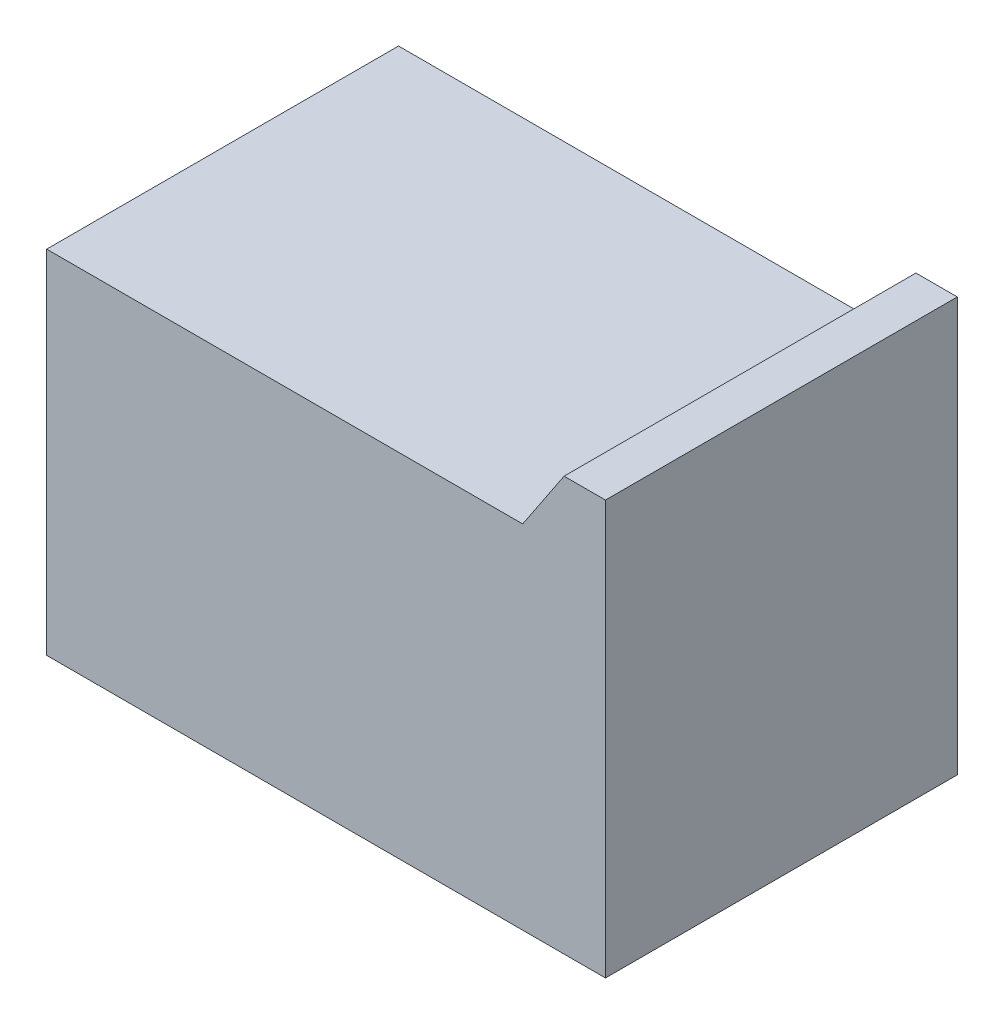
ISO-10303-21;
HEADER;
FILE_DESCRIPTION(('STEP AP214'),'2;1');
FILE_NAME('part.step','',(''),(''),'','','');
FILE_SCHEMA(('AUTOMOTIVE_DESIGN { 1 0 10303 214 1 1 1 1 }'));
ENDSEC;
DATA;
#1=APPLICATION_CONTEXT('core data for automotive mechanical design processes');
#2=APPLICATION_PROTOCOL_DEFINITION('international standard','automotive_design',2000,#1);
#3=PRODUCT_CONTEXT('',#1,'mechanical');
#4=PRODUCT('Part','Part','',(#3));
#5=PRODUCT_RELATED_PRODUCT_CATEGORY('part','',(#4));
#6=PRODUCT_DEFINITION_FORMATION('','',#4);
#7=PRODUCT_DEFINITION_CONTEXT('part definition',#1,'design');
#8=PRODUCT_DEFINITION('design','',#6,#7);
#9=PRODUCT_DEFINITION_SHAPE('','',#8);
#10=(LENGTH_UNIT() NAMED_UNIT(*) SI_UNIT(.MILLI.,.METRE.));
#11=(NAMED_UNIT(*) PLANE_ANGLE_UNIT() SI_UNIT($,.RADIAN.));
#12=(NAMED_UNIT(*) SI_UNIT($,.STERADIAN.) SOLID_ANGLE_UNIT());
#13=UNCERTAINTY_MEASURE_WITH_UNIT(LENGTH_MEASURE(1.E-05),#10,'distance_accuracy_value','');
#14=(GEOMETRIC_REPRESENTATION_CONTEXT(3) GLOBAL_UNCERTAINTY_ASSIGNED_CONTEXT((#13)) GLOBAL_UNIT_ASSIGNED_CONTEXT((#10,
#11,#12)) REPRESENTATION_CONTEXT('',''));
#15=CARTESIAN_POINT('',(0.,0.,0.));
#16=DIRECTION('',(0.,0.,1.));
#17=DIRECTION('',(1.,0.,0.));
#18=AXIS2_PLACEMENT_3D('',#15,#16,#17);
#19=CARTESIAN_POINT('',(342.9,508.,215.9));
#20=DIRECTION('',(-1.,0.,0.));
#21=DIRECTION('',(0.,0.,1.));
#22=AXIS2_PLACEMENT_3D('',#19,#20,#21);
#23=PLANE('',#22);
#24=DIRECTION('',(0.,0.,-1.));
#25=VECTOR('',#24,1.);
#26=CARTESIAN_POINT('',(342.9,0.,215.9));
#27=LINE('',#26,#25);
#28=CARTESIAN_POINT('',(342.9,0.,215.9));
#29=VERTEX_POINT('',#28);
#30=CARTESIAN_POINT('',(342.9,0.,-215.9));
#31=VERTEX_POINT('',#30);
#32=EDGE_CURVE('E92',#29,#31,#27,.T.);
#33=ORIENTED_EDGE('',*,*,#32,.T.);
#34=DIRECTION('',(0.,-1.,0.));
#35=VECTOR('',#34,1.);
#36=CARTESIAN_POINT('',(342.9,508.,-215.9));
#37=LINE('',#36,#35);
#38=CARTESIAN_POINT('',(342.9,508.,-215.9));
#39=VERTEX_POINT('',#38);
#40=EDGE_CURVE('E11',#39,#31,#37,.T.);
#41=ORIENTED_EDGE('',*,*,#40,.F.);
#42=DIRECTION('',(0.,0.,-1.));
#43=VECTOR('',#42,1.);
#44=CARTESIAN_POINT('',(342.9,508.,215.9));
#45=LINE('',#44,#43);
#46=CARTESIAN_POINT('',(342.9,508.,215.9));
#47=VERTEX_POINT('',#46);
#48=EDGE_CURVE('E86',#47,#39,#45,.T.);
#49=ORIENTED_EDGE('',*,*,#48,.F.);
#50=DIRECTION('',(0.,-1.,0.));
#51=VECTOR('',#50,1.);
#52=CARTESIAN_POINT('',(342.9,508.,215.9));
#53=LINE('',#52,#51);
#54=EDGE_CURVE('E77',#47,#29,#53,.T.);
#55=ORIENTED_EDGE('',*,*,#54,.T.);
#56=EDGE_LOOP('',(#33,#41,#49,#55));
#57=FACE_BOUND('',#56,.T.);
#58=ADVANCED_FACE('F33',(#57),#23,.F.);
#59=CARTESIAN_POINT('',(-342.9,508.,-215.9));
#60=DIRECTION('',(0.,0.,1.));
#61=DIRECTION('',(1.,0.,0.));
#62=AXIS2_PLACEMENT_3D('',#59,#60,#61);
#63=PLANE('',#62);
#64=DIRECTION('',(1.,0.,0.));
#65=VECTOR('',#64,1.);
#66=CARTESIAN_POINT('',(-342.9,431.8,-215.9));
#67=LINE('',#66,#65);
#68=CARTESIAN_POINT('',(-342.9,431.8,-215.9));
#69=VERTEX_POINT('',#68);
#70=CARTESIAN_POINT('',(241.3,431.8,-215.9));
#71=VERTEX_POINT('',#70);
#72=EDGE_CURVE('E127',#69,#71,#67,.T.);
#73=ORIENTED_EDGE('',*,*,#72,.T.);
#74=DIRECTION('',(0.55470019622523,0.832050294337843,0.));
#75=VECTOR('',#74,1.);
#76=CARTESIAN_POINT('',(241.3,431.8,-215.9));
#77=LINE('',#76,#75);
#78=CARTESIAN_POINT('',(292.1,508.,-215.9));
#79=VERTEX_POINT('',#78);
#80=EDGE_CURVE('E120',#71,#79,#77,.T.);
#81=ORIENTED_EDGE('',*,*,#80,.T.);
#82=DIRECTION('',(-1.,0.,0.));
#83=VECTOR('',#82,1.);
#84=CARTESIAN_POINT('',(-342.9,508.,-215.9));
#85=LINE('',#84,#83);
#86=EDGE_CURVE('E118',#39,#79,#85,.T.);
#87=ORIENTED_EDGE('',*,*,#86,.F.);
#88=ORIENTED_EDGE('',*,*,#40,.T.);
#89=DIRECTION('',(-1.,0.,0.));
#90=VECTOR('',#89,1.);
#91=CARTESIAN_POINT('',(-342.9,0.,-215.9));
#92=LINE('',#91,#90);
#93=CARTESIAN_POINT('',(-342.9,0.,-215.9));
#94=VERTEX_POINT('',#93);
#95=EDGE_CURVE('E96',#31,#94,#92,.T.);
#96=ORIENTED_EDGE('',*,*,#95,.T.);
#97=DIRECTION('',(0.,-1.,0.));
#98=VECTOR('',#97,1.);
#99=CARTESIAN_POINT('',(-342.9,508.,-215.9));
#100=LINE('',#99,#98);
#101=EDGE_CURVE('E40',#69,#94,#100,.T.);
#102=ORIENTED_EDGE('',*,*,#101,.F.);
#103=EDGE_LOOP('',(#73,#81,#87,#88,#96,#102));
#104=FACE_BOUND('',#103,.T.);
#105=ADVANCED_FACE('F115',(#104),#63,.F.);
#106=CARTESIAN_POINT('',(-342.9,508.,215.9));
#107=DIRECTION('',(1.,0.,0.));
#108=DIRECTION('',(0.,0.,-1.));
#109=AXIS2_PLACEMENT_3D('',#106,#107,#108);
#110=PLANE('',#109);
#111=DIRECTION('',(0.,-1.,0.));
#112=VECTOR('',#111,1.);
#113=CARTESIAN_POINT('',(-342.9,508.,215.9));
#114=LINE('',#113,#112);
#115=CARTESIAN_POINT('',(-342.9,431.8,215.9));
#116=VERTEX_POINT('',#115);
#117=CARTESIAN_POINT('',(-342.9,0.,215.9));
#118=VERTEX_POINT('',#117);
#119=EDGE_CURVE('E81',#116,#118,#114,.T.);
#120=ORIENTED_EDGE('',*,*,#119,.F.);
#121=DIRECTION('',(0.,0.,1.));
#122=VECTOR('',#121,1.);
#123=CARTESIAN_POINT('',(-342.9,431.8,-215.9));
#124=LINE('',#123,#122);
#125=EDGE_CURVE('E112',#69,#116,#124,.T.);
#126=ORIENTED_EDGE('',*,*,#125,.F.);
#127=ORIENTED_EDGE('',*,*,#101,.T.);
#128=DIRECTION('',(0.,0.,1.));
#129=VECTOR('',#128,1.);
#130=CARTESIAN_POINT('',(-342.9,0.,215.9));
#131=LINE('',#130,#129);
#132=EDGE_CURVE('E87',#94,#118,#131,.T.);
#133=ORIENTED_EDGE('',*,*,#132,.T.);
#134=EDGE_LOOP('',(#120,#126,#127,#133));
#135=FACE_BOUND('',#134,.T.);
#136=ADVANCED_FACE('F109',(#135),#110,.F.);
#137=CARTESIAN_POINT('',(-342.9,508.,215.9));
#138=DIRECTION('',(0.,0.,-1.));
#139=DIRECTION('',(-1.,0.,0.));
#140=AXIS2_PLACEMENT_3D('',#137,#138,#139);
#141=PLANE('',#140);
#142=DIRECTION('',(1.,0.,0.));
#143=VECTOR('',#142,1.);
#144=CARTESIAN_POINT('',(-342.9,508.,215.9));
#145=LINE('',#144,#143);
#146=CARTESIAN_POINT('',(292.1,508.,215.9));
#147=VERTEX_POINT('',#146);
#148=EDGE_CURVE('E55',#147,#47,#145,.T.);
#149=ORIENTED_EDGE('',*,*,#148,.F.);
#150=DIRECTION('',(0.55470019622523,0.832050294337843,0.));
#151=VECTOR('',#150,1.);
#152=CARTESIAN_POINT('',(241.3,431.8,215.9));
#153=LINE('',#152,#151);
#154=CARTESIAN_POINT('',(241.3,431.8,215.9));
#155=VERTEX_POINT('',#154);
#156=EDGE_CURVE('E47',#155,#147,#153,.T.);
#157=ORIENTED_EDGE('',*,*,#156,.F.);
#158=DIRECTION('',(1.,0.,0.));
#159=VECTOR('',#158,1.);
#160=CARTESIAN_POINT('',(-342.9,431.8,215.9));
#161=LINE('',#160,#159);
#162=EDGE_CURVE('E128',#116,#155,#161,.T.);
#163=ORIENTED_EDGE('',*,*,#162,.F.);
#164=ORIENTED_EDGE('',*,*,#119,.T.);
#165=DIRECTION('',(1.,0.,0.));
#166=VECTOR('',#165,1.);
#167=CARTESIAN_POINT('',(-342.9,0.,215.9));
#168=LINE('',#167,#166);
#169=EDGE_CURVE('E74',#118,#29,#168,.T.);
#170=ORIENTED_EDGE('',*,*,#169,.T.);
#171=ORIENTED_EDGE('',*,*,#54,.F.);
#172=EDGE_LOOP('',(#149,#157,#163,#164,#170,#171));
#173=FACE_BOUND('',#172,.T.);
#174=ADVANCED_FACE('F76',(#173),#141,.F.);
#175=CARTESIAN_POINT('',(0.,508.,0.));
#176=DIRECTION('',(0.,-1.,0.));
#177=DIRECTION('',(0.,0.,-1.));
#178=AXIS2_PLACEMENT_3D('',#175,#176,#177);
#179=PLANE('',#178);
#180=ORIENTED_EDGE('',*,*,#86,.T.);
#181=DIRECTION('',(0.,0.,1.));
#182=VECTOR('',#181,1.);
#183=CARTESIAN_POINT('',(292.1,508.,-215.9));
#184=LINE('',#183,#182);
#185=EDGE_CURVE('E97',#79,#147,#184,.T.);
#186=ORIENTED_EDGE('',*,*,#185,.T.);
#187=ORIENTED_EDGE('',*,*,#148,.T.);
#188=ORIENTED_EDGE('',*,*,#48,.T.);
#189=EDGE_LOOP('',(#180,#186,#187,#188));
#190=FACE_BOUND('',#189,.T.);
#191=ADVANCED_FACE('F121',(#190),#179,.F.);
#192=CARTESIAN_POINT('',(0.,0.,0.));
#193=DIRECTION('',(0.,-1.,0.));
#194=DIRECTION('',(0.,0.,-1.));
#195=AXIS2_PLACEMENT_3D('',#192,#193,#194);
#196=PLANE('',#195);
#197=ORIENTED_EDGE('',*,*,#32,.F.);
#198=ORIENTED_EDGE('',*,*,#169,.F.);
#199=ORIENTED_EDGE('',*,*,#132,.F.);
#200=ORIENTED_EDGE('',*,*,#95,.F.);
#201=EDGE_LOOP('',(#197,#198,#199,#200));
#202=FACE_BOUND('',#201,.T.);
#203=ADVANCED_FACE('F94',(#202),#196,.T.);
#204=CARTESIAN_POINT('',(241.3,431.8,-215.9));
#205=DIRECTION('',(0.832050294337843,-0.55470019622523,0.));
#206=DIRECTION('',(0.55470019622523,0.832050294337843,0.));
#207=AXIS2_PLACEMENT_3D('',#204,#205,#206);
#208=PLANE('',#207);
#209=ORIENTED_EDGE('',*,*,#156,.T.);
#210=ORIENTED_EDGE('',*,*,#185,.F.);
#211=ORIENTED_EDGE('',*,*,#80,.F.);
#212=DIRECTION('',(0.,0.,1.));
#213=VECTOR('',#212,1.);
#214=CARTESIAN_POINT('',(241.3,431.8,-215.9));
#215=LINE('',#214,#213);
#216=EDGE_CURVE('E100',#71,#155,#215,.T.);
#217=ORIENTED_EDGE('',*,*,#216,.T.);
#218=EDGE_LOOP('',(#209,#210,#211,#217));
#219=FACE_BOUND('',#218,.T.);
#220=ADVANCED_FACE('F143',(#219),#208,.F.);
#221=CARTESIAN_POINT('',(-342.9,431.8,-215.9));
#222=DIRECTION('',(0.,-1.,0.));
#223=DIRECTION('',(0.,0.,-1.));
#224=AXIS2_PLACEMENT_3D('',#221,#222,#223);
#225=PLANE('',#224);
#226=ORIENTED_EDGE('',*,*,#162,.T.);
#227=ORIENTED_EDGE('',*,*,#216,.F.);
#228=ORIENTED_EDGE('',*,*,#72,.F.);
#229=ORIENTED_EDGE('',*,*,#125,.T.);
#230=EDGE_LOOP('',(#226,#227,#228,#229));
#231=FACE_BOUND('',#230,.T.);
#232=ADVANCED_FACE('F137',(#231),#225,.F.);
#233=CLOSED_SHELL('',(#58,#105,#136,#174,#191,#203,#220,#232));
#234=MANIFOLD_SOLID_BREP('B2',#233);
#235=ADVANCED_BREP_SHAPE_REPRESENTATION('',(#18,#234),#14);
#236=SHAPE_DEFINITION_REPRESENTATION(#9,#235);
ENDSEC;
END-ISO-10303-21;
